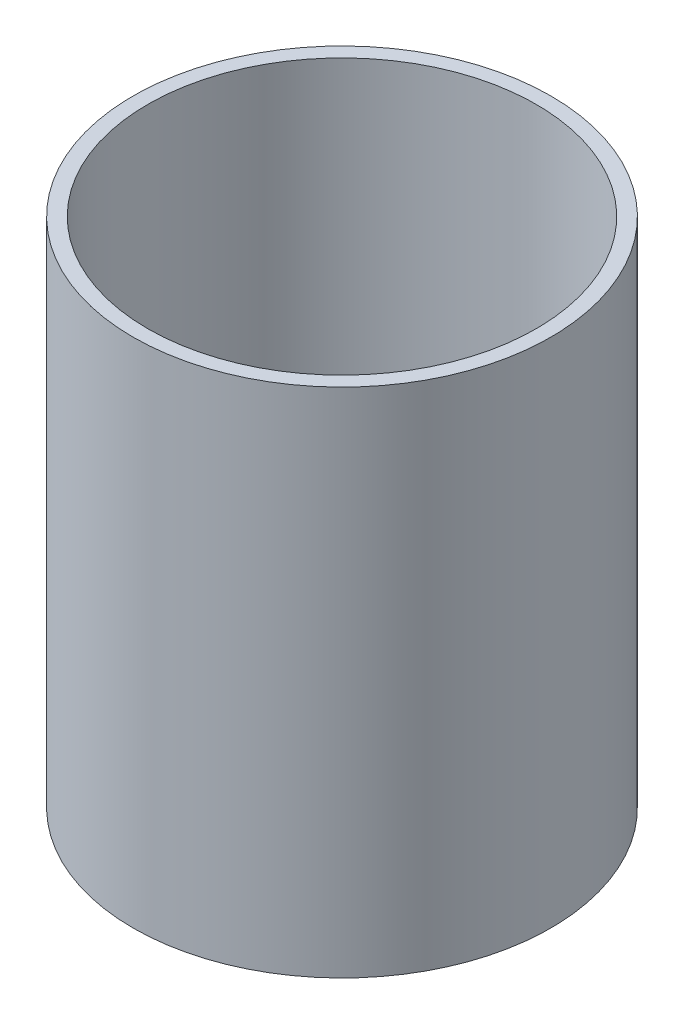
ISO-10303-21;
HEADER;
FILE_DESCRIPTION(('STEP AP214'),'2;1');
FILE_NAME('part.step','',(''),(''),'','','');
FILE_SCHEMA(('AUTOMOTIVE_DESIGN { 1 0 10303 214 1 1 1 1 }'));
ENDSEC;
DATA;
#1=APPLICATION_CONTEXT('core data for automotive mechanical design processes');
#2=APPLICATION_PROTOCOL_DEFINITION('international standard','automotive_design',2000,#1);
#3=PRODUCT_CONTEXT('',#1,'mechanical');
#4=PRODUCT('Part','Part','',(#3));
#5=PRODUCT_RELATED_PRODUCT_CATEGORY('part','',(#4));
#6=PRODUCT_DEFINITION_FORMATION('','',#4);
#7=PRODUCT_DEFINITION_CONTEXT('part definition',#1,'design');
#8=PRODUCT_DEFINITION('design','',#6,#7);
#9=PRODUCT_DEFINITION_SHAPE('','',#8);
#10=(LENGTH_UNIT() NAMED_UNIT(*) SI_UNIT(.MILLI.,.METRE.));
#11=(NAMED_UNIT(*) PLANE_ANGLE_UNIT() SI_UNIT($,.RADIAN.));
#12=(NAMED_UNIT(*) SI_UNIT($,.STERADIAN.) SOLID_ANGLE_UNIT());
#13=UNCERTAINTY_MEASURE_WITH_UNIT(LENGTH_MEASURE(1.E-05),#10,'distance_accuracy_value','');
#14=(GEOMETRIC_REPRESENTATION_CONTEXT(3) GLOBAL_UNCERTAINTY_ASSIGNED_CONTEXT((#13)) GLOBAL_UNIT_ASSIGNED_CONTEXT((#10,
#11,#12)) REPRESENTATION_CONTEXT('',''));
#15=CARTESIAN_POINT('',(0.,0.,0.));
#16=DIRECTION('',(0.,0.,1.));
#17=DIRECTION('',(1.,0.,0.));
#18=AXIS2_PLACEMENT_3D('',#15,#16,#17);
#19=CARTESIAN_POINT('',(0.,140.,0.));
#20=DIRECTION('',(0.,1.,0.));
#21=DIRECTION('',(0.,0.,1.));
#22=AXIS2_PLACEMENT_3D('',#19,#20,#21);
#23=PLANE('',#22);
#24=CARTESIAN_POINT('',(0.,140.,0.));
#25=DIRECTION('',(0.,1.,0.));
#26=DIRECTION('',(0.,0.,1.));
#27=AXIS2_PLACEMENT_3D('',#24,#25,#26);
#28=CIRCLE('',#27,57.15);
#29=CARTESIAN_POINT('',(0.,140.,57.15));
#30=VERTEX_POINT('',#29);
#31=EDGE_CURVE('E10',#30,#30,#28,.T.);
#32=ORIENTED_EDGE('',*,*,#31,.T.);
#33=EDGE_LOOP('',(#32));
#34=FACE_BOUND('',#33,.T.);
#35=CARTESIAN_POINT('',(0.,140.,0.));
#36=DIRECTION('',(0.,1.,0.));
#37=DIRECTION('',(0.,0.,1.));
#38=AXIS2_PLACEMENT_3D('',#35,#36,#37);
#39=CIRCLE('',#38,53.15);
#40=CARTESIAN_POINT('',(0.,140.,53.15));
#41=VERTEX_POINT('',#40);
#42=EDGE_CURVE('E50',#41,#41,#39,.T.);
#43=ORIENTED_EDGE('',*,*,#42,.F.);
#44=EDGE_LOOP('',(#43));
#45=FACE_BOUND('',#44,.T.);
#46=ADVANCED_FACE('F37',(#34,#45),#23,.T.);
#47=CARTESIAN_POINT('',(0.,0.,0.));
#48=DIRECTION('',(0.,1.,0.));
#49=DIRECTION('',(0.,0.,1.));
#50=AXIS2_PLACEMENT_3D('',#47,#48,#49);
#51=PLANE('',#50);
#52=CARTESIAN_POINT('',(0.,0.,0.));
#53=DIRECTION('',(0.,1.,0.));
#54=DIRECTION('',(0.,0.,1.));
#55=AXIS2_PLACEMENT_3D('',#52,#53,#54);
#56=CIRCLE('',#55,57.15);
#57=CARTESIAN_POINT('',(0.,0.,57.15));
#58=VERTEX_POINT('',#57);
#59=EDGE_CURVE('E41',#58,#58,#56,.T.);
#60=ORIENTED_EDGE('',*,*,#59,.F.);
#61=EDGE_LOOP('',(#60));
#62=FACE_BOUND('',#61,.T.);
#63=CARTESIAN_POINT('',(0.,0.,0.));
#64=DIRECTION('',(0.,1.,0.));
#65=DIRECTION('',(0.,0.,1.));
#66=AXIS2_PLACEMENT_3D('',#63,#64,#65);
#67=CIRCLE('',#66,53.15);
#68=CARTESIAN_POINT('',(0.,0.,53.15));
#69=VERTEX_POINT('',#68);
#70=EDGE_CURVE('E52',#69,#69,#67,.T.);
#71=ORIENTED_EDGE('',*,*,#70,.T.);
#72=EDGE_LOOP('',(#71));
#73=FACE_BOUND('',#72,.T.);
#74=ADVANCED_FACE('F64',(#62,#73),#51,.F.);
#75=CARTESIAN_POINT('',(0.,140.,0.));
#76=DIRECTION('',(0.,-1.,0.));
#77=DIRECTION('',(0.,0.,-1.));
#78=AXIS2_PLACEMENT_3D('',#75,#76,#77);
#79=CYLINDRICAL_SURFACE('',#78,57.15);
#80=ORIENTED_EDGE('',*,*,#31,.F.);
#81=EDGE_LOOP('',(#80));
#82=FACE_BOUND('',#81,.T.);
#83=ORIENTED_EDGE('',*,*,#59,.T.);
#84=EDGE_LOOP('',(#83));
#85=FACE_BOUND('',#84,.T.);
#86=ADVANCED_FACE('F39',(#82,#85),#79,.T.);
#87=CARTESIAN_POINT('',(0.,140.,0.));
#88=DIRECTION('',(0.,-1.,0.));
#89=DIRECTION('',(0.,0.,-1.));
#90=AXIS2_PLACEMENT_3D('',#87,#88,#89);
#91=CYLINDRICAL_SURFACE('',#90,53.15);
#92=ORIENTED_EDGE('',*,*,#42,.T.);
#93=EDGE_LOOP('',(#92));
#94=FACE_BOUND('',#93,.T.);
#95=ORIENTED_EDGE('',*,*,#70,.F.);
#96=EDGE_LOOP('',(#95));
#97=FACE_BOUND('',#96,.T.);
#98=ADVANCED_FACE('F60',(#94,#97),#91,.F.);
#99=CLOSED_SHELL('',(#46,#74,#86,#98));
#100=MANIFOLD_SOLID_BREP('B2',#99);
#101=ADVANCED_BREP_SHAPE_REPRESENTATION('',(#18,#100),#14);
#102=SHAPE_DEFINITION_REPRESENTATION(#9,#101);
ENDSEC;
END-ISO-10303-21;
